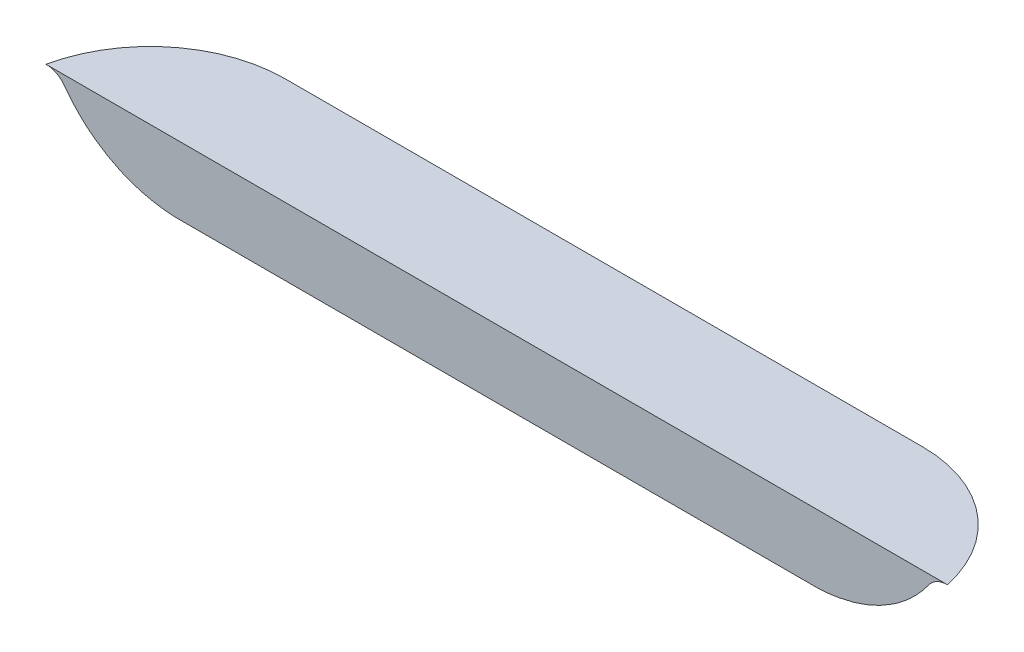
ISO-10303-21;
HEADER;
FILE_DESCRIPTION(('STEP AP214'),'2;1');
FILE_NAME('part.step','',(''),(''),'','','');
FILE_SCHEMA(('AUTOMOTIVE_DESIGN { 1 0 10303 214 1 1 1 1 }'));
ENDSEC;
DATA;
#1=APPLICATION_CONTEXT('core data for automotive mechanical design processes');
#2=APPLICATION_PROTOCOL_DEFINITION('international standard','automotive_design',2000,#1);
#3=PRODUCT_CONTEXT('',#1,'mechanical');
#4=PRODUCT('Part','Part','',(#3));
#5=PRODUCT_RELATED_PRODUCT_CATEGORY('part','',(#4));
#6=PRODUCT_DEFINITION_FORMATION('','',#4);
#7=PRODUCT_DEFINITION_CONTEXT('part definition',#1,'design');
#8=PRODUCT_DEFINITION('design','',#6,#7);
#9=PRODUCT_DEFINITION_SHAPE('','',#8);
#10=(LENGTH_UNIT() NAMED_UNIT(*) SI_UNIT(.MILLI.,.METRE.));
#11=(NAMED_UNIT(*) PLANE_ANGLE_UNIT() SI_UNIT($,.RADIAN.));
#12=(NAMED_UNIT(*) SI_UNIT($,.STERADIAN.) SOLID_ANGLE_UNIT());
#13=UNCERTAINTY_MEASURE_WITH_UNIT(LENGTH_MEASURE(1.E-05),#10,'distance_accuracy_value','');
#14=(GEOMETRIC_REPRESENTATION_CONTEXT(3) GLOBAL_UNCERTAINTY_ASSIGNED_CONTEXT((#13)) GLOBAL_UNIT_ASSIGNED_CONTEXT((#10,
#11,#12)) REPRESENTATION_CONTEXT('',''));
#15=CARTESIAN_POINT('',(0.,0.,0.));
#16=DIRECTION('',(0.,0.,1.));
#17=DIRECTION('',(1.,0.,0.));
#18=AXIS2_PLACEMENT_3D('',#15,#16,#17);
#19=CARTESIAN_POINT('',(598.25205,-5.94502642283601,424.78142074394));
#20=DIRECTION('',(0.,1.,0.));
#21=DIRECTION('',(0.,0.,1.));
#22=AXIS2_PLACEMENT_3D('',#19,#20,#21);
#23=CONICAL_SURFACE('',#22,3.36464758630939,1.30899693900327);
#24=CARTESIAN_POINT('',(593.055197127108,-5.29663685039883,422.241180954901));
#25=CARTESIAN_POINT('',(593.188791931849,-5.32879378561836,422.241180954901));
#26=CARTESIAN_POINT('',(593.322439794992,-5.36073139259823,422.241180954901));
#27=CARTESIAN_POINT('',(593.589868210562,-5.42405544009137,422.241180954901));
#28=CARTESIAN_POINT('',(593.723648765078,-5.45544187177163,422.241180954901));
#29=CARTESIAN_POINT('',(594.125253463156,-5.54861118556001,422.241180954901));
#30=CARTESIAN_POINT('',(594.393310155456,-5.60939669402866,422.241180954901));
#31=CARTESIAN_POINT('',(594.92803989107,-5.72637322434292,422.241180954901));
#32=CARTESIAN_POINT('',(595.194705186714,-5.78259906575234,422.241180954901));
#33=CARTESIAN_POINT('',(595.595723176225,-5.86203971259894,422.241180954901));
#34=CARTESIAN_POINT('',(595.729588086311,-5.88770741811087,422.241180954901));
#35=CARTESIAN_POINT('',(595.997705534534,-5.93692151404419,422.241180954901));
#36=CARTESIAN_POINT('',(596.131958059337,-5.9604679765526,422.241180954901));
#37=CARTESIAN_POINT('',(596.402490324506,-6.0051093393665,422.241180954901));
#38=CARTESIAN_POINT('',(596.538775390791,-6.02617229363636,422.241180954901));
#39=CARTESIAN_POINT('',(596.811855608967,-6.06476024563379,422.241180954901));
#40=CARTESIAN_POINT('',(596.948650771656,-6.08228516802093,422.241180954901));
#41=CARTESIAN_POINT('',(597.222620781238,-6.11291480874598,422.241180954901));
#42=CARTESIAN_POINT('',(597.35979517987,-6.12602346116473,422.241180954901));
#43=CARTESIAN_POINT('',(597.634536671336,-6.1469908697348,422.241180954901));
#44=CARTESIAN_POINT('',(597.772103711469,-6.1548502999761,422.241180954901));
#45=CARTESIAN_POINT('',(598.04848644823,-6.16473671628947,422.241180954901));
#46=CARTESIAN_POINT('',(598.187303770159,-6.16671950615644,422.241180954901));
#47=CARTESIAN_POINT('',(598.464912828626,-6.1645537404517,422.241180954901));
#48=CARTESIAN_POINT('',(598.603704557359,-6.16040419018726,422.241180954901));
#49=CARTESIAN_POINT('',(598.881535656476,-6.14629468056983,422.241180954901));
#50=CARTESIAN_POINT('',(599.020573802785,-6.13631158637721,422.241180954901));
#51=CARTESIAN_POINT('',(599.298158397924,-6.11131081648023,422.241180954901));
#52=CARTESIAN_POINT('',(599.436704984572,-6.09629468695539,422.241180954901));
#53=CARTESIAN_POINT('',(599.574956877652,-6.07915560377438,422.241180954901));
#54=B_SPLINE_CURVE_WITH_KNOTS('',3,(#24,#25,#26,#27,#28,#29,#30,#31,#32,#33,#34,#35,#36,#37,#38,
#39,#40,#41,#42,#43,#44,#45,#46,#47,#48,#49,#50,#51,#52,#53),.UNSPECIFIED.,.F.,.F.,(4,2,2,2,2,2,
2,2,2,2,2,2,2,2,4),(0.,0.412231523682999,0.824469647663224,1.64903999961058,2.46656484950443,
2.8754626428602,3.28434653523736,3.69801974529922,4.1117017633749,4.5250142866966,
4.93827372340498,5.35463335463406,5.7710605286514,6.18915049902553,6.60711214712309),.UNSPECIFIED.);
#55=CARTESIAN_POINT('',(596.045687565077,-5.94502642283601,422.241180954901));
#56=VERTEX_POINT('',#55);
#57=CARTESIAN_POINT('',(598.25205,-6.16592582635617,422.241180954901));
#58=VERTEX_POINT('',#57);
#59=EDGE_CURVE('E54',#56,#58,#54,.T.);
#60=ORIENTED_EDGE('',*,*,#59,.F.);
#61=CARTESIAN_POINT('',(598.25205,-5.94502642283601,424.78142074394));
#62=DIRECTION('',(0.,1.,0.));
#63=DIRECTION('',(0.,0.,1.));
#64=AXIS2_PLACEMENT_3D('',#61,#62,#63);
#65=CIRCLE('',#64,3.36464758630938);
#66=CARTESIAN_POINT('',(598.25205,-5.94502642284393,421.416773157578));
#67=VERTEX_POINT('',#66);
#68=EDGE_CURVE('E257',#67,#56,#65,.T.);
#69=ORIENTED_EDGE('',*,*,#68,.F.);
#70=DIRECTION('',(0.,0.258819045102514,-0.96592582628907));
#71=VECTOR('',#70,1.);
#72=CARTESIAN_POINT('',(598.25205,-5.94502642285183,421.416773157608));
#73=LINE('',#72,#71);
#74=EDGE_CURVE('E260',#58,#67,#73,.T.);
#75=ORIENTED_EDGE('',*,*,#74,.F.);
#76=EDGE_LOOP('',(#60,#69,#75));
#77=FACE_BOUND('',#76,.T.);
#78=ADVANCED_FACE('F41',(#77),#23,.T.);
#79=CARTESIAN_POINT('',(656.24795,-5.94502642285183,421.416773157608));
#80=DIRECTION('',(0.,-0.96592582628907,-0.258819045102514));
#81=DIRECTION('',(0.,0.258819045102514,-0.96592582628907));
#82=AXIS2_PLACEMENT_3D('',#79,#80,#81);
#83=PLANE('',#82);
#84=DIRECTION('',(0.,-0.258819045102515,0.96592582628907));
#85=VECTOR('',#84,1.);
#86=CARTESIAN_POINT('',(656.247950000061,133585.980603453,-498150.437158512));
#87=LINE('',#86,#85);
#88=CARTESIAN_POINT('',(656.24795,-6.16592582635617,422.241180954901));
#89=VERTEX_POINT('',#88);
#90=CARTESIAN_POINT('',(656.24795,-5.94502642282766,421.416773157583));
#91=VERTEX_POINT('',#90);
#92=EDGE_CURVE('E250',#89,#91,#87,.F.);
#93=ORIENTED_EDGE('',*,*,#92,.F.);
#94=DIRECTION('',(1.,0.,0.));
#95=VECTOR('',#94,1.);
#96=CARTESIAN_POINT('',(656.24795,-6.16592582636956,422.241180954898));
#97=LINE('',#96,#95);
#98=EDGE_CURVE('E252',#89,#58,#97,.F.);
#99=ORIENTED_EDGE('',*,*,#98,.T.);
#100=ORIENTED_EDGE('',*,*,#74,.T.);
#101=DIRECTION('',(-1.,0.,0.));
#102=VECTOR('',#101,1.);
#103=CARTESIAN_POINT('',(656.24795,-5.94502642285184,421.416773157608));
#104=LINE('',#103,#102);
#105=EDGE_CURVE('E254',#91,#67,#104,.T.);
#106=ORIENTED_EDGE('',*,*,#105,.F.);
#107=EDGE_LOOP('',(#93,#99,#100,#106));
#108=FACE_BOUND('',#107,.T.);
#109=ADVANCED_FACE('F238',(#108),#83,.T.);
#110=CARTESIAN_POINT('',(656.24795,-5.94502642283601,424.78142074394));
#111=DIRECTION('',(0.,1.,0.));
#112=DIRECTION('',(0.,0.,1.));
#113=AXIS2_PLACEMENT_3D('',#110,#111,#112);
#114=CONICAL_SURFACE('',#113,3.36464758630939,1.30899693900327);
#115=CARTESIAN_POINT('',(653.92726367263,-5.92464875687682,422.241180954901));
#116=CARTESIAN_POINT('',(654.035478953888,-5.94419587200267,422.241180954901));
#117=CARTESIAN_POINT('',(654.143827264884,-5.96304158653321,422.241180954901));
#118=CARTESIAN_POINT('',(654.36083811508,-5.99896904956372,422.241180954901));
#119=CARTESIAN_POINT('',(654.469500714975,-6.01605043019519,422.241180954901));
#120=CARTESIAN_POINT('',(654.687347459853,-6.0481096672788,422.241180954901));
#121=CARTESIAN_POINT('',(654.796532200844,-6.0630835171297,422.241180954901));
#122=CARTESIAN_POINT('',(655.015221183715,-6.0904564704621,422.241180954901));
#123=CARTESIAN_POINT('',(655.124725407594,-6.10285571626524,422.241180954901));
#124=CARTESIAN_POINT('',(655.34256017799,-6.12448594890685,422.241180954901));
#125=CARTESIAN_POINT('',(655.450886657372,-6.13375737525884,422.241180954901));
#126=CARTESIAN_POINT('',(655.667772894768,-6.14896166554394,422.241180954901));
#127=CARTESIAN_POINT('',(655.776332643185,-6.15489466429188,422.241180954901));
#128=CARTESIAN_POINT('',(655.993496781614,-6.16312531745736,422.241180954901));
#129=CARTESIAN_POINT('',(656.102101048719,-6.16542615951397,422.241180954901));
#130=CARTESIAN_POINT('',(656.319324039833,-6.16627923692829,422.241180954901));
#131=CARTESIAN_POINT('',(656.427942763779,-6.16483148775412,422.241180954901));
#132=CARTESIAN_POINT('',(656.64515835265,-6.15826272102793,422.241180954901));
#133=CARTESIAN_POINT('',(656.753755123381,-6.15313863350865,422.241180954901));
#134=CARTESIAN_POINT('',(656.970736315259,-6.13947399119799,422.241180954901));
#135=CARTESIAN_POINT('',(657.079120721371,-6.13093320271647,422.241180954901));
#136=CARTESIAN_POINT('',(657.40395264633,-6.10074328188256,422.241180954901));
#137=CARTESIAN_POINT('',(657.619977067549,-6.07453031913214,422.241180954901));
#138=CARTESIAN_POINT('',(658.051995011536,-6.01320003247234,422.241180954901));
#139=CARTESIAN_POINT('',(658.267980846625,-5.97803113341116,422.241180954901));
#140=CARTESIAN_POINT('',(658.698839818356,-5.90175807243907,422.241180954901));
#141=CARTESIAN_POINT('',(658.91371317,-5.86065510537218,422.241180954901));
#142=CARTESIAN_POINT('',(659.300951906874,-5.78283127728358,422.241180954901));
#143=CARTESIAN_POINT('',(659.47346041317,-5.7468118920592,422.241180954901));
#144=CARTESIAN_POINT('',(659.818067324864,-5.67285488347948,422.241180954901));
#145=CARTESIAN_POINT('',(659.99016572374,-5.63491722982319,422.241180954901));
#146=CARTESIAN_POINT('',(660.506027874561,-5.51898465439337,422.241180954901));
#147=CARTESIAN_POINT('',(660.849315519465,-5.43887905793651,422.241180954901));
#148=CARTESIAN_POINT('',(661.530315870674,-5.27655596818082,422.241180954901));
#149=CARTESIAN_POINT('',(661.868039458582,-5.19438361585229,422.241180954901));
#150=CARTESIAN_POINT('',(662.374197846651,-5.06962309649266,422.241180954901));
#151=CARTESIAN_POINT('',(662.5428198198,-5.02779258072699,422.241180954901));
#152=CARTESIAN_POINT('',(662.879958699188,-4.94371568264826,422.241180954901));
#153=CARTESIAN_POINT('',(663.048475606235,-4.90146930357815,422.241180954901));
#154=CARTESIAN_POINT('',(663.216951099456,-4.8590590726636,422.241180954901));
#155=B_SPLINE_CURVE_WITH_KNOTS('',3,(#115,#116,#117,#118,#119,#120,#121,#122,#123,#124,#125,
#126,#127,#128,#129,#130,#131,#132,#133,#134,#135,#136,#137,#138,#139,#140,#141,#142,#143,#144,
#145,#146,#147,#148,#149,#150,#151,#152,#153,#154),.UNSPECIFIED.,.F.,.F.,(4,2,2,2,2,2,2,2,2,2,2,
2,2,2,2,2,2,2,2,4),(0.,0.32990662135162,0.659881890882438,0.990476235743663,1.32105230079989,
1.64717401378928,1.97328255614854,2.29910474098537,2.62492558135667,2.95101881919862,
3.27713436446784,3.92967058164962,4.5860531103819,5.24230365819819,5.77097795735399,
6.29966061005314,7.35715783379959,8.3998807781775,8.92107933898223,9.4422738386211),.UNSPECIFIED.);
#156=CARTESIAN_POINT('',(658.454312434901,-5.94502642283981,422.241180954901));
#157=VERTEX_POINT('',#156);
#158=EDGE_CURVE('E225',#89,#157,#155,.T.);
#159=ORIENTED_EDGE('',*,*,#158,.F.);
#160=ORIENTED_EDGE('',*,*,#92,.T.);
#161=CARTESIAN_POINT('',(656.24795,-5.94502642283982,424.78142074394));
#162=DIRECTION('',(0.,1.,0.));
#163=DIRECTION('',(0.,0.,1.));
#164=AXIS2_PLACEMENT_3D('',#161,#162,#163);
#165=CIRCLE('',#164,3.36464758629518);
#166=EDGE_CURVE('E268',#157,#91,#165,.T.);
#167=ORIENTED_EDGE('',*,*,#166,.F.);
#168=EDGE_LOOP('',(#159,#160,#167));
#169=FACE_BOUND('',#168,.T.);
#170=ADVANCED_FACE('F234',(#169),#114,.T.);
#171=CARTESIAN_POINT('',(598.25205,6.61200931890607,424.78142074394));
#172=DIRECTION('',(-1.,0.,0.));
#173=DIRECTION('',(0.,1.,0.));
#174=AXIS2_PLACEMENT_3D('',#171,#172,#173);
#175=SPHERICAL_SURFACE('',#174,13.);
#176=CARTESIAN_POINT('',(587.85577416045,-0.768006296399972,422.241180954901));
#177=CARTESIAN_POINT('',(587.99417037519,-0.962979060654481,422.241180954901));
#178=CARTESIAN_POINT('',(588.138062797423,-1.15404914752956,422.241180954901));
#179=CARTESIAN_POINT('',(588.436352799606,-1.52779298583839,422.241180954901));
#180=CARTESIAN_POINT('',(588.590749961396,-1.71046707100493,422.241180954901));
#181=CARTESIAN_POINT('',(588.909571230919,-2.06684124794357,422.241180954901));
#182=CARTESIAN_POINT('',(589.07399521013,-2.2405414546881,422.241180954901));
#183=CARTESIAN_POINT('',(589.412168369898,-2.57824164367296,422.241180954901));
#184=CARTESIAN_POINT('',(589.585907434098,-2.74225175821442,422.241180954901));
#185=CARTESIAN_POINT('',(589.942324306909,-3.06025382969546,422.241180954901));
#186=CARTESIAN_POINT('',(590.125001979465,-3.21424593903738,422.241180954901));
#187=CARTESIAN_POINT('',(590.498702770357,-3.51171722653505,422.241180954901));
#188=CARTESIAN_POINT('',(590.689725766643,-3.65519655835738,422.241180954901));
#189=CARTESIAN_POINT('',(591.177200874559,-4.00034785111493,422.241180954901));
#190=CARTESIAN_POINT('',(591.478540746515,-4.19517553251928,422.241180954901));
#191=CARTESIAN_POINT('',(592.096578451322,-4.55875347466338,422.241180954901));
#192=CARTESIAN_POINT('',(592.413278260357,-4.72750036814024,422.241180954901));
#193=CARTESIAN_POINT('',(593.059634467425,-5.03764441187687,422.241180954901));
#194=CARTESIAN_POINT('',(593.389285228989,-5.17905330485361,422.241180954901));
#195=CARTESIAN_POINT('',(594.059297753753,-5.43358761384428,422.241180954901));
#196=CARTESIAN_POINT('',(594.399658129077,-5.54671667782636,422.241180954901));
#197=CARTESIAN_POINT('',(595.028877278152,-5.72679445656809,422.241180954901));
#198=CARTESIAN_POINT('',(595.316428090325,-5.79834980161024,422.241180954901));
#199=CARTESIAN_POINT('',(595.895788313574,-5.92126191513763,422.241180954901));
#200=CARTESIAN_POINT('',(596.187597180569,-5.97262124117808,422.241180954901));
#201=CARTESIAN_POINT('',(596.774105797423,-6.05489770966141,422.241180954901));
#202=CARTESIAN_POINT('',(597.068805799018,-6.08581305569356,422.241180954901));
#203=CARTESIAN_POINT('',(597.659685884462,-6.12706950144567,422.241180954901));
#204=CARTESIAN_POINT('',(597.955866180536,-6.13740756099674,422.241180954901));
#205=CARTESIAN_POINT('',(598.25205,-6.13738995377269,422.241180954901));
#206=B_SPLINE_CURVE_WITH_KNOTS('',3,(#176,#177,#178,#179,#180,#181,#182,#183,#184,#185,#186,
#187,#188,#189,#190,#191,#192,#193,#194,#195,#196,#197,#198,#199,#200,#201,#202,#203,#204,#205),
.UNSPECIFIED.,.F.,.F.,(4,2,2,2,2,2,2,2,2,2,2,2,2,2,4),(0.,0.71719811587753,1.43436769913744,
2.15152809181297,2.86792481803668,3.58431064327938,4.30068599493073,5.37584256127005,
6.45113782418472,7.52597017539683,8.60066380653937,9.48893236496205,10.3770883998202,
11.2653224665053,12.1536877546328),.UNSPECIFIED.);
#207=CARTESIAN_POINT('',(587.915718640084,-0.851732090882292,422.241180954901));
#208=VERTEX_POINT('',#207);
#209=EDGE_CURVE('E12',#208,#56,#206,.T.);
#210=ORIENTED_EDGE('',*,*,#209,.F.);
#211=CARTESIAN_POINT('',(598.25205,-0.851732090882292,424.78142074394));
#212=DIRECTION('',(0.,1.,0.));
#213=DIRECTION('',(1.,0.,0.));
#214=AXIS2_PLACEMENT_3D('',#211,#212,#213);
#215=CIRCLE('',#214,10.6438979780816);
#216=CARTESIAN_POINT('',(598.25205,-0.85173209088229,414.137522765859));
#217=VERTEX_POINT('',#216);
#218=EDGE_CURVE('E133',#208,#217,#215,.F.);
#219=ORIENTED_EDGE('',*,*,#218,.T.);
#220=CARTESIAN_POINT('',(598.25205,6.61200931890607,424.78142074394));
#221=DIRECTION('',(-1.,0.,0.));
#222=DIRECTION('',(0.,0.,1.));
#223=AXIS2_PLACEMENT_3D('',#220,#221,#222);
#224=CIRCLE('',#223,13.);
#225=EDGE_CURVE('E270',#67,#217,#224,.F.);
#226=ORIENTED_EDGE('',*,*,#225,.F.);
#227=ORIENTED_EDGE('',*,*,#68,.T.);
#228=EDGE_LOOP('',(#210,#219,#226,#227));
#229=FACE_BOUND('',#228,.T.);
#230=ADVANCED_FACE('F237',(#229),#175,.T.);
#231=CARTESIAN_POINT('',(656.24795,6.61200931890607,424.78142074394));
#232=DIRECTION('',(-1.,0.,0.));
#233=DIRECTION('',(0.,0.,1.));
#234=AXIS2_PLACEMENT_3D('',#231,#232,#233);
#235=CYLINDRICAL_SURFACE('',#234,13.);
#236=CARTESIAN_POINT('',(656.24795,6.61200931890607,424.78142074394));
#237=DIRECTION('',(1.,0.,0.));
#238=DIRECTION('',(0.,-1.,0.));
#239=AXIS2_PLACEMENT_3D('',#236,#237,#238);
#240=CIRCLE('',#239,13.);
#241=CARTESIAN_POINT('',(656.24795,-0.851732090882254,414.137522765859));
#242=VERTEX_POINT('',#241);
#243=EDGE_CURVE('E267',#91,#242,#240,.T.);
#244=ORIENTED_EDGE('',*,*,#243,.F.);
#245=ORIENTED_EDGE('',*,*,#105,.T.);
#246=ORIENTED_EDGE('',*,*,#225,.T.);
#247=DIRECTION('',(-1.,0.,0.));
#248=VECTOR('',#247,1.);
#249=CARTESIAN_POINT('',(656.24795,-0.851732090882261,414.137522765859));
#250=LINE('',#249,#248);
#251=EDGE_CURVE('E132',#217,#242,#250,.F.);
#252=ORIENTED_EDGE('',*,*,#251,.T.);
#253=EDGE_LOOP('',(#244,#245,#246,#252));
#254=FACE_BOUND('',#253,.T.);
#255=ADVANCED_FACE('F276',(#254),#235,.T.);
#256=CARTESIAN_POINT('',(656.24795,6.61200931890607,424.78142074394));
#257=DIRECTION('',(1.,0.,0.));
#258=DIRECTION('',(0.,-1.,0.));
#259=AXIS2_PLACEMENT_3D('',#256,#257,#258);
#260=SPHERICAL_SURFACE('',#259,13.);
#261=CARTESIAN_POINT('',(656.24795,-6.13738995377269,422.241180954901));
#262=CARTESIAN_POINT('',(656.487048078198,-6.13739754794715,422.241180954901));
#263=CARTESIAN_POINT('',(656.72614527687,-6.130664282625,422.241180954901));
#264=CARTESIAN_POINT('',(657.203573960387,-6.10377126808436,422.241180954901));
#265=CARTESIAN_POINT('',(657.441905475316,-6.08361205302841,422.241180954901));
#266=CARTESIAN_POINT('',(657.917054936365,-6.02992271001446,422.241180954901));
#267=CARTESIAN_POINT('',(658.153872901842,-5.99639275340906,422.241180954901));
#268=CARTESIAN_POINT('',(658.62499686518,-5.91611377236874,422.241180954901));
#269=CARTESIAN_POINT('',(658.859305269376,-5.86937886224479,422.241180954901));
#270=CARTESIAN_POINT('',(659.324927155757,-5.76282106753376,422.241180954901));
#271=CARTESIAN_POINT('',(659.556240683461,-5.70299838210939,422.241180954901));
#272=CARTESIAN_POINT('',(660.01512593023,-5.57046243115274,422.241180954901));
#273=CARTESIAN_POINT('',(660.242697703952,-5.49774935409408,422.241180954901));
#274=CARTESIAN_POINT('',(660.806321275596,-5.30003778332064,422.241180954901));
#275=CARTESIAN_POINT('',(661.139621314815,-5.16709182539795,422.241180954901));
#276=CARTESIAN_POINT('',(661.793847001033,-4.87358155969948,422.241180954901));
#277=CARTESIAN_POINT('',(662.114771046173,-4.71301369133358,422.241180954901));
#278=CARTESIAN_POINT('',(662.74181721195,-4.36548127519753,422.241180954901));
#279=CARTESIAN_POINT('',(663.047945645299,-4.17852812088419,422.241180954901));
#280=CARTESIAN_POINT('',(663.643339327759,-3.77951576433249,422.241180954901));
#281=CARTESIAN_POINT('',(663.932606748166,-3.56745980544628,422.241180954901));
#282=CARTESIAN_POINT('',(664.443672820115,-3.15861238395229,422.241180954901));
#283=CARTESIAN_POINT('',(664.668470751969,-2.96555403313736,422.241180954901));
#284=CARTESIAN_POINT('',(665.104061136421,-2.56427274412886,422.241180954901));
#285=CARTESIAN_POINT('',(665.31485535959,-2.35605173004405,422.241180954901));
#286=CARTESIAN_POINT('',(665.721447976347,-1.92541938231664,422.241180954901));
#287=CARTESIAN_POINT('',(665.9172450508,-1.70300680354479,422.241180954901));
#288=CARTESIAN_POINT('',(666.292919037088,-1.24506529448846,422.241180954901));
#289=CARTESIAN_POINT('',(666.472793592718,-1.00953443134078,422.241180954901));
#290=CARTESIAN_POINT('',(666.644225839551,-0.768006296399983,422.241180954901));
#291=B_SPLINE_CURVE_WITH_KNOTS('',3,(#261,#262,#263,#264,#265,#266,#267,#268,#269,#270,#271,
#272,#273,#274,#275,#276,#277,#278,#279,#280,#281,#282,#283,#284,#285,#286,#287,#288,#289,#290),
.UNSPECIFIED.,.F.,.F.,(4,2,2,2,2,2,2,2,2,2,2,2,2,2,4),(0.,0.717198115877521,1.43436769913732,
2.15152809181279,2.8679248180365,3.58431064327942,4.30068599493067,5.37584256127012,
6.45113782418471,7.52597017539679,8.60066380653939,9.48893236496212,10.3770883998201,
11.2653224665053,12.1536877546329),.UNSPECIFIED.);
#292=CARTESIAN_POINT('',(666.584281359917,-0.851732090882256,422.241180954901));
#293=VERTEX_POINT('',#292);
#294=EDGE_CURVE('E121',#157,#293,#291,.T.);
#295=ORIENTED_EDGE('',*,*,#294,.F.);
#296=ORIENTED_EDGE('',*,*,#166,.T.);
#297=ORIENTED_EDGE('',*,*,#243,.T.);
#298=CARTESIAN_POINT('',(656.24795,-0.851732090882256,424.78142074394));
#299=DIRECTION('',(0.,1.,0.));
#300=DIRECTION('',(1.,0.,0.));
#301=AXIS2_PLACEMENT_3D('',#298,#299,#300);
#302=CIRCLE('',#301,10.6438979780816);
#303=EDGE_CURVE('E139',#242,#293,#302,.F.);
#304=ORIENTED_EDGE('',*,*,#303,.T.);
#305=EDGE_LOOP('',(#295,#296,#297,#304));
#306=FACE_BOUND('',#305,.T.);
#307=ADVANCED_FACE('F186',(#306),#260,.T.);
#308=CARTESIAN_POINT('',(598.25205,-2.00000000008049,424.78142074394));
#309=DIRECTION('',(0.,1.,0.));
#310=DIRECTION('',(1.,0.,0.));
#311=AXIS2_PLACEMENT_3D('',#308,#309,#310);
#312=TOROIDAL_SURFACE('',#311,12.2814207439403,2.);
#313=ORIENTED_EDGE('',*,*,#218,.F.);
#314=CARTESIAN_POINT('',(587.915718640084,-0.851732090882335,422.241180954901));
#315=CARTESIAN_POINT('',(587.881962459816,-0.804984849582509,422.241180954901));
#316=CARTESIAN_POINT('',(587.846208958938,-0.759717836632521,422.241180954901));
#317=CARTESIAN_POINT('',(587.770975857237,-0.672407272396535,422.241180954901));
#318=CARTESIAN_POINT('',(587.73149691278,-0.630363155643694,422.241180954901));
#319=CARTESIAN_POINT('',(587.608072259403,-0.509647422916211,422.241180954901));
#320=CARTESIAN_POINT('',(587.518958549192,-0.436144150882375,422.241180954901));
#321=CARTESIAN_POINT('',(587.329791315518,-0.305046466955372,422.241180954901));
#322=CARTESIAN_POINT('',(587.22973710045,-0.247453061619177,422.241180954901));
#323=CARTESIAN_POINT('',(587.021478054613,-0.149555668146466,422.241180954901));
#324=CARTESIAN_POINT('',(586.913273656408,-0.109250763195432,422.241180954901));
#325=CARTESIAN_POINT('',(586.710481775904,-0.0522329621287982,422.241180954901));
#326=CARTESIAN_POINT('',(586.616678342674,-0.0326863917844849,422.241180954901));
#327=CARTESIAN_POINT('',(586.427329956834,-0.00655819322882235,422.241180954901));
#328=CARTESIAN_POINT('',(586.33178586066,2.96458326746024E-05,422.241180954901));
#329=CARTESIAN_POINT('',(586.236207237053,-8.04894345618479E-11,422.241180954901));
#330=B_SPLINE_CURVE_WITH_KNOTS('',3,(#314,#315,#316,#317,#318,#319,#320,#321,#322,#323,#324,
#325,#326,#327,#328,#329),.UNSPECIFIED.,.F.,.F.,(4,2,2,2,2,2,2,4),(0.,0.172869902111098,
0.345709403922912,0.69048003126973,1.03527246595463,1.38004661392896,1.66663087745646,
1.95307775361329),.UNSPECIFIED.);
#331=CARTESIAN_POINT('',(586.236207237053,-8.04894345618479E-11,422.241180954901));
#332=VERTEX_POINT('',#331);
#333=EDGE_CURVE('E114',#208,#332,#330,.T.);
#334=ORIENTED_EDGE('',*,*,#333,.T.);
#335=CARTESIAN_POINT('',(598.25205,-8.04894345618479E-11,424.78142074394));
#336=DIRECTION('',(0.,-1.,0.));
#337=DIRECTION('',(-0.978375630431503,0.,-0.206835987627297));
#338=AXIS2_PLACEMENT_3D('',#335,#336,#337);
#339=CIRCLE('',#338,12.2814207439404);
#340=CARTESIAN_POINT('',(598.25205,-4.02438499191859E-11,412.5));
#341=VERTEX_POINT('',#340);
#342=EDGE_CURVE('E107',#341,#332,#339,.F.);
#343=ORIENTED_EDGE('',*,*,#342,.F.);
#344=CARTESIAN_POINT('',(598.25205,-2.00000000008049,412.5));
#345=DIRECTION('',(-1.,0.,0.));
#346=DIRECTION('',(0.,0.,1.));
#347=AXIS2_PLACEMENT_3D('',#344,#345,#346);
#348=CIRCLE('',#347,2.);
#349=EDGE_CURVE('E112',#341,#217,#348,.F.);
#350=ORIENTED_EDGE('',*,*,#349,.T.);
#351=EDGE_LOOP('',(#313,#334,#343,#350));
#352=FACE_BOUND('',#351,.T.);
#353=ADVANCED_FACE('F111',(#352),#312,.F.);
#354=CARTESIAN_POINT('',(656.24795,-2.00000000008049,412.5));
#355=DIRECTION('',(-1.,0.,0.));
#356=DIRECTION('',(0.,0.,1.));
#357=AXIS2_PLACEMENT_3D('',#354,#355,#356);
#358=CYLINDRICAL_SURFACE('',#357,2.);
#359=ORIENTED_EDGE('',*,*,#251,.F.);
#360=ORIENTED_EDGE('',*,*,#349,.F.);
#361=DIRECTION('',(1.,0.,0.));
#362=VECTOR('',#361,1.);
#363=CARTESIAN_POINT('',(757.25,0.,412.5));
#364=LINE('',#363,#362);
#365=CARTESIAN_POINT('',(656.24795,0.,412.5));
#366=VERTEX_POINT('',#365);
#367=EDGE_CURVE('E129',#341,#366,#364,.T.);
#368=ORIENTED_EDGE('',*,*,#367,.T.);
#369=CARTESIAN_POINT('',(656.24795,-2.00000000008049,412.5));
#370=DIRECTION('',(-1.,0.,0.));
#371=DIRECTION('',(0.,0.,-1.));
#372=AXIS2_PLACEMENT_3D('',#369,#370,#371);
#373=CIRCLE('',#372,2.);
#374=EDGE_CURVE('E61',#366,#242,#373,.F.);
#375=ORIENTED_EDGE('',*,*,#374,.T.);
#376=EDGE_LOOP('',(#359,#360,#368,#375));
#377=FACE_BOUND('',#376,.T.);
#378=ADVANCED_FACE('F128',(#377),#358,.F.);
#379=CARTESIAN_POINT('',(656.24795,-2.00000000008049,424.78142074394));
#380=DIRECTION('',(0.,1.,0.));
#381=DIRECTION('',(1.,0.,0.));
#382=AXIS2_PLACEMENT_3D('',#379,#380,#381);
#383=TOROIDAL_SURFACE('',#382,12.2814207439403,2.);
#384=CARTESIAN_POINT('',(656.24795,-8.04894345618479E-11,424.78142074394));
#385=DIRECTION('',(0.,-1.,0.));
#386=DIRECTION('',(0.,0.,-1.));
#387=AXIS2_PLACEMENT_3D('',#384,#385,#386);
#388=CIRCLE('',#387,12.2814207439403);
#389=CARTESIAN_POINT('',(668.263792762947,-8.04894345618479E-11,422.241180954901));
#390=VERTEX_POINT('',#389);
#391=EDGE_CURVE('E136',#366,#390,#388,.T.);
#392=ORIENTED_EDGE('',*,*,#391,.T.);
#393=CARTESIAN_POINT('',(668.263792762947,-4.02447172809239E-11,422.241180954901));
#394=CARTESIAN_POINT('',(668.205035993274,-1.13050884309797E-06,422.241180954901));
#395=CARTESIAN_POINT('',(668.146308056544,-0.00247999833394348,422.241180954901));
#396=CARTESIAN_POINT('',(668.029269866086,-0.0123641706849971,422.241180954901));
#397=CARTESIAN_POINT('',(667.970959600969,-0.0197693403575325,422.241180954901));
#398=CARTESIAN_POINT('',(667.797304995898,-0.0493114694215126,422.241180954901));
#399=CARTESIAN_POINT('',(667.68311926129,-0.0787751752172698,422.241180954901));
#400=CARTESIAN_POINT('',(667.461284427633,-0.156463800135738,422.241180954901));
#401=CARTESIAN_POINT('',(667.353640621069,-0.204703681794263,422.241180954901));
#402=CARTESIAN_POINT('',(667.14811637223,-0.31866200705661,422.241180954901));
#403=CARTESIAN_POINT('',(667.050226379613,-0.384363117799046,422.241180954901));
#404=CARTESIAN_POINT('',(666.887887912137,-0.514810745989035,422.241180954901));
#405=CARTESIAN_POINT('',(666.820884718044,-0.576408664632128,422.241180954901));
#406=CARTESIAN_POINT('',(666.695674574926,-0.708015364466931,422.241180954901));
#407=CARTESIAN_POINT('',(666.637470971871,-0.778027326956936,422.241180954901));
#408=CARTESIAN_POINT('',(666.584281359917,-0.851732090882236,422.241180954901));
#409=B_SPLINE_CURVE_WITH_KNOTS('',3,(#393,#394,#395,#396,#397,#398,#399,#400,#401,#402,#403,
#404,#405,#406,#407,#408),.UNSPECIFIED.,.F.,.F.,(4,2,2,2,2,2,2,4),(0.,0.176161029930979,
0.352317237798624,0.704281361790328,1.05652653840891,1.40842335699125,1.68068643474608,
1.95305277928641),.UNSPECIFIED.);
#410=EDGE_CURVE('E145',#390,#293,#409,.T.);
#411=ORIENTED_EDGE('',*,*,#410,.T.);
#412=ORIENTED_EDGE('',*,*,#303,.F.);
#413=ORIENTED_EDGE('',*,*,#374,.F.);
#414=EDGE_LOOP('',(#392,#411,#412,#413));
#415=FACE_BOUND('',#414,.T.);
#416=ADVANCED_FACE('F155',(#415),#383,.F.);
#417=CARTESIAN_POINT('',(586.236207237053,-13.1,422.241180954901));
#418=DIRECTION('',(0.,0.,1.));
#419=DIRECTION('',(1.,0.,0.));
#420=AXIS2_PLACEMENT_3D('',#417,#418,#419);
#421=PLANE('',#420);
#422=ORIENTED_EDGE('',*,*,#333,.F.);
#423=ORIENTED_EDGE('',*,*,#209,.T.);
#424=ORIENTED_EDGE('',*,*,#59,.T.);
#425=ORIENTED_EDGE('',*,*,#98,.F.);
#426=ORIENTED_EDGE('',*,*,#158,.T.);
#427=ORIENTED_EDGE('',*,*,#294,.T.);
#428=ORIENTED_EDGE('',*,*,#410,.F.);
#429=DIRECTION('',(1.,0.,0.));
#430=VECTOR('',#429,1.);
#431=CARTESIAN_POINT('',(586.236207237053,0.,422.241180954901));
#432=LINE('',#431,#430);
#433=EDGE_CURVE('E122',#332,#390,#432,.T.);
#434=ORIENTED_EDGE('',*,*,#433,.F.);
#435=EDGE_LOOP('',(#422,#423,#424,#425,#426,#427,#428,#434));
#436=FACE_BOUND('',#435,.T.);
#437=ADVANCED_FACE('F43',(#436),#421,.T.);
#438=CARTESIAN_POINT('',(0.,0.,0.));
#439=DIRECTION('',(0.,-1.,0.));
#440=DIRECTION('',(0.,0.,-1.));
#441=AXIS2_PLACEMENT_3D('',#438,#439,#440);
#442=PLANE('',#441);
#443=ORIENTED_EDGE('',*,*,#367,.F.);
#444=ORIENTED_EDGE('',*,*,#342,.T.);
#445=ORIENTED_EDGE('',*,*,#433,.T.);
#446=ORIENTED_EDGE('',*,*,#391,.F.);
#447=EDGE_LOOP('',(#443,#444,#445,#446));
#448=FACE_BOUND('',#447,.T.);
#449=ADVANCED_FACE('F135',(#448),#442,.F.);
#450=CLOSED_SHELL('',(#78,#109,#170,#230,#255,#307,#353,#378,#416,#437,#449));
#451=MANIFOLD_SOLID_BREP('B2',#450);
#452=ADVANCED_BREP_SHAPE_REPRESENTATION('',(#18,#451),#14);
#453=SHAPE_DEFINITION_REPRESENTATION(#9,#452);
ENDSEC;
END-ISO-10303-21;
